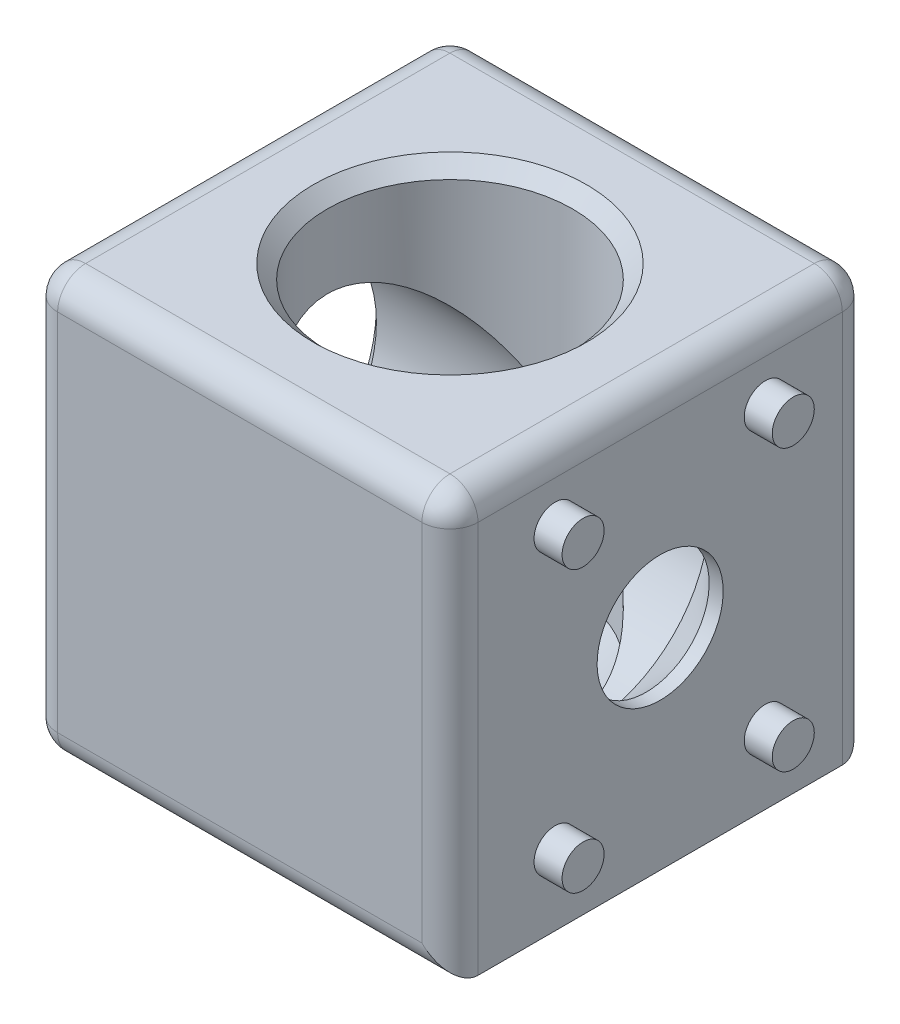
ISO-10303-21;
HEADER;
FILE_DESCRIPTION(('STEP AP214'),'2;1');
FILE_NAME('part.step','',(''),(''),'','','');
FILE_SCHEMA(('AUTOMOTIVE_DESIGN { 1 0 10303 214 1 1 1 1 }'));
ENDSEC;
DATA;
#1=APPLICATION_CONTEXT('core data for automotive mechanical design processes');
#2=APPLICATION_PROTOCOL_DEFINITION('international standard','automotive_design',2000,#1);
#3=PRODUCT_CONTEXT('',#1,'mechanical');
#4=PRODUCT('Part','Part','',(#3));
#5=PRODUCT_RELATED_PRODUCT_CATEGORY('part','',(#4));
#6=PRODUCT_DEFINITION_FORMATION('','',#4);
#7=PRODUCT_DEFINITION_CONTEXT('part definition',#1,'design');
#8=PRODUCT_DEFINITION('design','',#6,#7);
#9=PRODUCT_DEFINITION_SHAPE('','',#8);
#10=(LENGTH_UNIT() NAMED_UNIT(*) SI_UNIT(.MILLI.,.METRE.));
#11=(NAMED_UNIT(*) PLANE_ANGLE_UNIT() SI_UNIT($,.RADIAN.));
#12=(NAMED_UNIT(*) SI_UNIT($,.STERADIAN.) SOLID_ANGLE_UNIT());
#13=UNCERTAINTY_MEASURE_WITH_UNIT(LENGTH_MEASURE(1.E-05),#10,'distance_accuracy_value','');
#14=(GEOMETRIC_REPRESENTATION_CONTEXT(3) GLOBAL_UNCERTAINTY_ASSIGNED_CONTEXT((#13)) GLOBAL_UNIT_ASSIGNED_CONTEXT((#10,
#11,#12)) REPRESENTATION_CONTEXT('',''));
#15=CARTESIAN_POINT('',(0.,0.,0.));
#16=DIRECTION('',(0.,0.,1.));
#17=DIRECTION('',(1.,0.,0.));
#18=AXIS2_PLACEMENT_3D('',#15,#16,#17);
#19=CARTESIAN_POINT('',(0.,15.,0.));
#20=DIRECTION('',(0.,1.,0.));
#21=DIRECTION('',(-1.,0.,0.));
#22=AXIS2_PLACEMENT_3D('',#19,#20,#21);
#23=CYLINDRICAL_SURFACE('',#22,8.75);
#24=CARTESIAN_POINT('',(0.,14.,0.));
#25=DIRECTION('',(0.,1.,0.));
#26=DIRECTION('',(-1.,0.,0.));
#27=AXIS2_PLACEMENT_3D('',#24,#25,#26);
#28=CIRCLE('',#27,8.75);
#29=CARTESIAN_POINT('',(-8.75,14.,0.));
#30=VERTEX_POINT('',#29);
#31=EDGE_CURVE('E315',#30,#30,#28,.T.);
#32=ORIENTED_EDGE('',*,*,#31,.T.);
#33=EDGE_LOOP('',(#32));
#34=FACE_BOUND('',#33,.T.);
#35=CARTESIAN_POINT('',(0.,0.,0.));
#36=DIRECTION('',(0.707106781186547,0.707106781186548,0.));
#37=DIRECTION('',(-0.707106781186548,0.707106781186547,0.));
#38=AXIS2_PLACEMENT_3D('',#35,#36,#37);
#39=ELLIPSE('',#38,12.3743686707646,8.75);
#40=CARTESIAN_POINT('',(0.,0.,8.75));
#41=VERTEX_POINT('',#40);
#42=CARTESIAN_POINT('',(0.,0.,-8.75));
#43=VERTEX_POINT('',#42);
#44=EDGE_CURVE('E131',#41,#43,#39,.F.);
#45=ORIENTED_EDGE('',*,*,#44,.T.);
#46=CARTESIAN_POINT('',(0.,0.,0.));
#47=DIRECTION('',(-0.707106781186548,0.707106781186547,0.));
#48=DIRECTION('',(0.707106781186547,0.707106781186548,0.));
#49=AXIS2_PLACEMENT_3D('',#46,#47,#48);
#50=ELLIPSE('',#49,12.3743686707646,8.75);
#51=EDGE_CURVE('E127',#43,#41,#50,.F.);
#52=ORIENTED_EDGE('',*,*,#51,.T.);
#53=EDGE_LOOP('',(#45,#52));
#54=FACE_BOUND('',#53,.T.);
#55=ADVANCED_FACE('F35',(#34,#54),#23,.F.);
#56=CARTESIAN_POINT('',(15.,15.,15.));
#57=DIRECTION('',(-1.,0.,0.));
#58=DIRECTION('',(0.,0.,1.));
#59=AXIS2_PLACEMENT_3D('',#56,#57,#58);
#60=PLANE('',#59);
#61=DIRECTION('',(0.,0.,-1.));
#62=VECTOR('',#61,1.);
#63=CARTESIAN_POINT('',(15.,-15.,15.));
#64=LINE('',#63,#62);
#65=CARTESIAN_POINT('',(15.,-15.,13.));
#66=VERTEX_POINT('',#65);
#67=CARTESIAN_POINT('',(15.,-15.,-13.));
#68=VERTEX_POINT('',#67);
#69=EDGE_CURVE('E137',#66,#68,#64,.T.);
#70=ORIENTED_EDGE('',*,*,#69,.T.);
#71=DIRECTION('',(0.,-1.,0.));
#72=VECTOR('',#71,1.);
#73=CARTESIAN_POINT('',(15.,15.,-13.));
#74=LINE('',#73,#72);
#75=CARTESIAN_POINT('',(15.,13.,-13.));
#76=VERTEX_POINT('',#75);
#77=EDGE_CURVE('E164',#68,#76,#74,.F.);
#78=ORIENTED_EDGE('',*,*,#77,.T.);
#79=DIRECTION('',(0.,0.,-1.));
#80=VECTOR('',#79,1.);
#81=CARTESIAN_POINT('',(15.,13.,15.));
#82=LINE('',#81,#80);
#83=CARTESIAN_POINT('',(15.,13.,13.));
#84=VERTEX_POINT('',#83);
#85=EDGE_CURVE('E160',#76,#84,#82,.F.);
#86=ORIENTED_EDGE('',*,*,#85,.T.);
#87=DIRECTION('',(0.,-1.,0.));
#88=VECTOR('',#87,1.);
#89=CARTESIAN_POINT('',(15.,15.,13.));
#90=LINE('',#89,#88);
#91=EDGE_CURVE('E162',#84,#66,#90,.T.);
#92=ORIENTED_EDGE('',*,*,#91,.T.);
#93=EDGE_LOOP('',(#70,#78,#86,#92));
#94=FACE_BOUND('',#93,.T.);
#95=CARTESIAN_POINT('',(15.,-9.99999999999999,7.5));
#96=DIRECTION('',(-1.,0.,0.));
#97=DIRECTION('',(0.,0.,-1.));
#98=AXIS2_PLACEMENT_3D('',#95,#96,#97);
#99=CIRCLE('',#98,1.5);
#100=CARTESIAN_POINT('',(15.,-9.99999999999999,6.));
#101=VERTEX_POINT('',#100);
#102=EDGE_CURVE('E242',#101,#101,#99,.T.);
#103=ORIENTED_EDGE('',*,*,#102,.T.);
#104=EDGE_LOOP('',(#103));
#105=FACE_BOUND('',#104,.T.);
#106=CARTESIAN_POINT('',(15.,-9.99999999999999,-7.5));
#107=DIRECTION('',(-1.,0.,0.));
#108=DIRECTION('',(0.,0.,-1.));
#109=AXIS2_PLACEMENT_3D('',#106,#107,#108);
#110=CIRCLE('',#109,1.5);
#111=CARTESIAN_POINT('',(15.,-9.99999999999999,-9.));
#112=VERTEX_POINT('',#111);
#113=EDGE_CURVE('E253',#112,#112,#110,.T.);
#114=ORIENTED_EDGE('',*,*,#113,.T.);
#115=EDGE_LOOP('',(#114));
#116=FACE_BOUND('',#115,.T.);
#117=CARTESIAN_POINT('',(15.,10.,7.5));
#118=DIRECTION('',(-1.,0.,0.));
#119=DIRECTION('',(0.,0.,-1.));
#120=AXIS2_PLACEMENT_3D('',#117,#118,#119);
#121=CIRCLE('',#120,1.5);
#122=CARTESIAN_POINT('',(15.,10.,6.));
#123=VERTEX_POINT('',#122);
#124=EDGE_CURVE('E259',#123,#123,#121,.T.);
#125=ORIENTED_EDGE('',*,*,#124,.T.);
#126=EDGE_LOOP('',(#125));
#127=FACE_BOUND('',#126,.T.);
#128=CARTESIAN_POINT('',(15.,10.,-7.5));
#129=DIRECTION('',(-1.,0.,0.));
#130=DIRECTION('',(0.,0.,-1.));
#131=AXIS2_PLACEMENT_3D('',#128,#129,#130);
#132=CIRCLE('',#131,1.5);
#133=CARTESIAN_POINT('',(15.,10.,-9.));
#134=VERTEX_POINT('',#133);
#135=EDGE_CURVE('E265',#134,#134,#132,.T.);
#136=ORIENTED_EDGE('',*,*,#135,.T.);
#137=EDGE_LOOP('',(#136));
#138=FACE_BOUND('',#137,.T.);
#139=CARTESIAN_POINT('',(15.,0.,0.));
#140=DIRECTION('',(1.,0.,0.));
#141=DIRECTION('',(0.,1.,0.));
#142=AXIS2_PLACEMENT_3D('',#139,#140,#141);
#143=CIRCLE('',#142,4.5);
#144=CARTESIAN_POINT('',(15.,4.5,0.));
#145=VERTEX_POINT('',#144);
#146=EDGE_CURVE('E285',#145,#145,#143,.T.);
#147=ORIENTED_EDGE('',*,*,#146,.F.);
#148=EDGE_LOOP('',(#147));
#149=FACE_BOUND('',#148,.T.);
#150=ADVANCED_FACE('F330',(#94,#105,#116,#127,#138,#149),#60,.F.);
#151=CARTESIAN_POINT('',(-15.,15.,-15.));
#152=DIRECTION('',(0.,0.,1.));
#153=DIRECTION('',(1.,0.,0.));
#154=AXIS2_PLACEMENT_3D('',#151,#152,#153);
#155=PLANE('',#154);
#156=DIRECTION('',(0.,-1.,0.));
#157=VECTOR('',#156,1.);
#158=CARTESIAN_POINT('',(13.,15.,-15.));
#159=LINE('',#158,#157);
#160=CARTESIAN_POINT('',(13.,13.,-15.));
#161=VERTEX_POINT('',#160);
#162=CARTESIAN_POINT('',(13.,-13.,-15.));
#163=VERTEX_POINT('',#162);
#164=EDGE_CURVE('E148',#161,#163,#159,.T.);
#165=ORIENTED_EDGE('',*,*,#164,.T.);
#166=DIRECTION('',(-1.,0.,0.));
#167=VECTOR('',#166,1.);
#168=CARTESIAN_POINT('',(-15.,-13.,-15.));
#169=LINE('',#168,#167);
#170=CARTESIAN_POINT('',(-13.,-13.,-15.));
#171=VERTEX_POINT('',#170);
#172=EDGE_CURVE('E150',#163,#171,#169,.T.);
#173=ORIENTED_EDGE('',*,*,#172,.T.);
#174=DIRECTION('',(0.,-1.,0.));
#175=VECTOR('',#174,1.);
#176=CARTESIAN_POINT('',(-13.,15.,-15.));
#177=LINE('',#176,#175);
#178=CARTESIAN_POINT('',(-13.,13.,-15.));
#179=VERTEX_POINT('',#178);
#180=EDGE_CURVE('E146',#171,#179,#177,.F.);
#181=ORIENTED_EDGE('',*,*,#180,.T.);
#182=DIRECTION('',(-1.,0.,0.));
#183=VECTOR('',#182,1.);
#184=CARTESIAN_POINT('',(-15.,13.,-15.));
#185=LINE('',#184,#183);
#186=EDGE_CURVE('E139',#179,#161,#185,.F.);
#187=ORIENTED_EDGE('',*,*,#186,.T.);
#188=EDGE_LOOP('',(#165,#173,#181,#187));
#189=FACE_BOUND('',#188,.T.);
#190=ADVANCED_FACE('F371',(#189),#155,.F.);
#191=CARTESIAN_POINT('',(-15.,15.,15.));
#192=DIRECTION('',(1.,0.,0.));
#193=DIRECTION('',(0.,0.,-1.));
#194=AXIS2_PLACEMENT_3D('',#191,#192,#193);
#195=PLANE('',#194);
#196=DIRECTION('',(0.,-1.,0.));
#197=VECTOR('',#196,1.);
#198=CARTESIAN_POINT('',(-15.,15.,-13.));
#199=LINE('',#198,#197);
#200=CARTESIAN_POINT('',(-15.,13.,-13.));
#201=VERTEX_POINT('',#200);
#202=CARTESIAN_POINT('',(-15.,-13.,-13.));
#203=VERTEX_POINT('',#202);
#204=EDGE_CURVE('E175',#201,#203,#199,.T.);
#205=ORIENTED_EDGE('',*,*,#204,.T.);
#206=DIRECTION('',(0.,0.,1.));
#207=VECTOR('',#206,1.);
#208=CARTESIAN_POINT('',(-15.,-13.,15.));
#209=LINE('',#208,#207);
#210=CARTESIAN_POINT('',(-15.,-13.,13.));
#211=VERTEX_POINT('',#210);
#212=EDGE_CURVE('E181',#203,#211,#209,.T.);
#213=ORIENTED_EDGE('',*,*,#212,.T.);
#214=DIRECTION('',(0.,-1.,0.));
#215=VECTOR('',#214,1.);
#216=CARTESIAN_POINT('',(-15.,15.,13.));
#217=LINE('',#216,#215);
#218=CARTESIAN_POINT('',(-15.,13.,13.));
#219=VERTEX_POINT('',#218);
#220=EDGE_CURVE('E179',#211,#219,#217,.F.);
#221=ORIENTED_EDGE('',*,*,#220,.T.);
#222=DIRECTION('',(0.,0.,1.));
#223=VECTOR('',#222,1.);
#224=CARTESIAN_POINT('',(-15.,13.,15.));
#225=LINE('',#224,#223);
#226=EDGE_CURVE('E177',#219,#201,#225,.F.);
#227=ORIENTED_EDGE('',*,*,#226,.T.);
#228=EDGE_LOOP('',(#205,#213,#221,#227));
#229=FACE_BOUND('',#228,.T.);
#230=CARTESIAN_POINT('',(-15.,0.,0.));
#231=DIRECTION('',(1.,0.,0.));
#232=DIRECTION('',(0.,1.,0.));
#233=AXIS2_PLACEMENT_3D('',#230,#231,#232);
#234=CIRCLE('',#233,9.75);
#235=CARTESIAN_POINT('',(-15.,9.74999999999999,0.));
#236=VERTEX_POINT('',#235);
#237=EDGE_CURVE('E271',#236,#236,#234,.T.);
#238=ORIENTED_EDGE('',*,*,#237,.T.);
#239=EDGE_LOOP('',(#238));
#240=FACE_BOUND('',#239,.T.);
#241=ADVANCED_FACE('F428',(#229,#240),#195,.F.);
#242=CARTESIAN_POINT('',(-15.,15.,15.));
#243=DIRECTION('',(0.,0.,-1.));
#244=DIRECTION('',(-1.,0.,0.));
#245=AXIS2_PLACEMENT_3D('',#242,#243,#244);
#246=PLANE('',#245);
#247=DIRECTION('',(0.,-1.,0.));
#248=VECTOR('',#247,1.);
#249=CARTESIAN_POINT('',(-13.,15.,15.));
#250=LINE('',#249,#248);
#251=CARTESIAN_POINT('',(-13.,13.,15.));
#252=VERTEX_POINT('',#251);
#253=CARTESIAN_POINT('',(-13.,-13.,15.));
#254=VERTEX_POINT('',#253);
#255=EDGE_CURVE('E168',#252,#254,#250,.T.);
#256=ORIENTED_EDGE('',*,*,#255,.T.);
#257=DIRECTION('',(1.,0.,0.));
#258=VECTOR('',#257,1.);
#259=CARTESIAN_POINT('',(15.,-13.,15.));
#260=LINE('',#259,#258);
#261=CARTESIAN_POINT('',(13.,-13.,15.));
#262=VERTEX_POINT('',#261);
#263=EDGE_CURVE('E172',#254,#262,#260,.T.);
#264=ORIENTED_EDGE('',*,*,#263,.T.);
#265=DIRECTION('',(0.,-1.,0.));
#266=VECTOR('',#265,1.);
#267=CARTESIAN_POINT('',(13.,15.,15.));
#268=LINE('',#267,#266);
#269=CARTESIAN_POINT('',(13.,13.,15.));
#270=VERTEX_POINT('',#269);
#271=EDGE_CURVE('E170',#262,#270,#268,.F.);
#272=ORIENTED_EDGE('',*,*,#271,.T.);
#273=DIRECTION('',(1.,0.,0.));
#274=VECTOR('',#273,1.);
#275=CARTESIAN_POINT('',(-15.,13.,15.));
#276=LINE('',#275,#274);
#277=EDGE_CURVE('E166',#270,#252,#276,.F.);
#278=ORIENTED_EDGE('',*,*,#277,.T.);
#279=EDGE_LOOP('',(#256,#264,#272,#278));
#280=FACE_BOUND('',#279,.T.);
#281=ADVANCED_FACE('F390',(#280),#246,.F.);
#282=CARTESIAN_POINT('',(0.,15.,0.));
#283=DIRECTION('',(0.,-1.,0.));
#284=DIRECTION('',(0.,0.,-1.));
#285=AXIS2_PLACEMENT_3D('',#282,#283,#284);
#286=PLANE('',#285);
#287=DIRECTION('',(1.,0.,0.));
#288=VECTOR('',#287,1.);
#289=CARTESIAN_POINT('',(0.,15.,13.));
#290=LINE('',#289,#288);
#291=CARTESIAN_POINT('',(-13.,15.,13.));
#292=VERTEX_POINT('',#291);
#293=CARTESIAN_POINT('',(13.,15.,13.));
#294=VERTEX_POINT('',#293);
#295=EDGE_CURVE('E44',#292,#294,#290,.T.);
#296=ORIENTED_EDGE('',*,*,#295,.T.);
#297=DIRECTION('',(0.,0.,-1.));
#298=VECTOR('',#297,1.);
#299=CARTESIAN_POINT('',(13.,15.,0.));
#300=LINE('',#299,#298);
#301=CARTESIAN_POINT('',(13.,15.,-13.));
#302=VERTEX_POINT('',#301);
#303=EDGE_CURVE('E11',#294,#302,#300,.T.);
#304=ORIENTED_EDGE('',*,*,#303,.T.);
#305=DIRECTION('',(-1.,0.,0.));
#306=VECTOR('',#305,1.);
#307=CARTESIAN_POINT('',(0.,15.,-13.));
#308=LINE('',#307,#306);
#309=CARTESIAN_POINT('',(-13.,15.,-13.));
#310=VERTEX_POINT('',#309);
#311=EDGE_CURVE('E184',#302,#310,#308,.T.);
#312=ORIENTED_EDGE('',*,*,#311,.T.);
#313=DIRECTION('',(0.,0.,1.));
#314=VECTOR('',#313,1.);
#315=CARTESIAN_POINT('',(-13.,15.,0.));
#316=LINE('',#315,#314);
#317=EDGE_CURVE('E55',#310,#292,#316,.T.);
#318=ORIENTED_EDGE('',*,*,#317,.T.);
#319=EDGE_LOOP('',(#296,#304,#312,#318));
#320=FACE_BOUND('',#319,.T.);
#321=CARTESIAN_POINT('',(0.,15.,0.));
#322=DIRECTION('',(0.,1.,0.));
#323=DIRECTION('',(-1.,0.,0.));
#324=AXIS2_PLACEMENT_3D('',#321,#322,#323);
#325=CIRCLE('',#324,9.75);
#326=CARTESIAN_POINT('',(-9.75,15.,0.));
#327=VERTEX_POINT('',#326);
#328=EDGE_CURVE('E310',#327,#327,#325,.T.);
#329=ORIENTED_EDGE('',*,*,#328,.F.);
#330=EDGE_LOOP('',(#329));
#331=FACE_BOUND('',#330,.T.);
#332=ADVANCED_FACE('F387',(#320,#331),#286,.F.);
#333=CARTESIAN_POINT('',(0.,-15.,0.));
#334=DIRECTION('',(0.,-1.,0.));
#335=DIRECTION('',(0.,0.,-1.));
#336=AXIS2_PLACEMENT_3D('',#333,#334,#335);
#337=PLANE('',#336);
#338=CARTESIAN_POINT('',(10.,-15.,7.5));
#339=DIRECTION('',(0.,-1.,0.));
#340=DIRECTION('',(0.,0.,-1.));
#341=AXIS2_PLACEMENT_3D('',#338,#339,#340);
#342=CIRCLE('',#341,1.5);
#343=CARTESIAN_POINT('',(10.,-15.,6.));
#344=VERTEX_POINT('',#343);
#345=EDGE_CURVE('E288',#344,#344,#342,.T.);
#346=ORIENTED_EDGE('',*,*,#345,.F.);
#347=EDGE_LOOP('',(#346));
#348=FACE_BOUND('',#347,.T.);
#349=CARTESIAN_POINT('',(10.,-15.,-7.5));
#350=DIRECTION('',(0.,-1.,0.));
#351=DIRECTION('',(0.,0.,-1.));
#352=AXIS2_PLACEMENT_3D('',#349,#350,#351);
#353=CIRCLE('',#352,1.5);
#354=CARTESIAN_POINT('',(10.,-15.,-9.));
#355=VERTEX_POINT('',#354);
#356=EDGE_CURVE('E292',#355,#355,#353,.T.);
#357=ORIENTED_EDGE('',*,*,#356,.F.);
#358=EDGE_LOOP('',(#357));
#359=FACE_BOUND('',#358,.T.);
#360=CARTESIAN_POINT('',(-10.,-15.,7.5));
#361=DIRECTION('',(0.,-1.,0.));
#362=DIRECTION('',(0.,0.,-1.));
#363=AXIS2_PLACEMENT_3D('',#360,#361,#362);
#364=CIRCLE('',#363,1.5);
#365=CARTESIAN_POINT('',(-10.,-15.,6.));
#366=VERTEX_POINT('',#365);
#367=EDGE_CURVE('E298',#366,#366,#364,.T.);
#368=ORIENTED_EDGE('',*,*,#367,.F.);
#369=EDGE_LOOP('',(#368));
#370=FACE_BOUND('',#369,.T.);
#371=CARTESIAN_POINT('',(-10.,-15.,-7.5));
#372=DIRECTION('',(0.,-1.,0.));
#373=DIRECTION('',(0.,0.,-1.));
#374=AXIS2_PLACEMENT_3D('',#371,#372,#373);
#375=CIRCLE('',#374,1.5);
#376=CARTESIAN_POINT('',(-10.,-15.,-9.));
#377=VERTEX_POINT('',#376);
#378=EDGE_CURVE('E304',#377,#377,#375,.T.);
#379=ORIENTED_EDGE('',*,*,#378,.F.);
#380=EDGE_LOOP('',(#379));
#381=FACE_BOUND('',#380,.T.);
#382=CARTESIAN_POINT('',(0.,-15.,0.));
#383=DIRECTION('',(0.,1.,0.));
#384=DIRECTION('',(-1.,0.,0.));
#385=AXIS2_PLACEMENT_3D('',#382,#383,#384);
#386=CIRCLE('',#385,4.5);
#387=CARTESIAN_POINT('',(-4.5,-15.,0.));
#388=VERTEX_POINT('',#387);
#389=EDGE_CURVE('E324',#388,#388,#386,.T.);
#390=ORIENTED_EDGE('',*,*,#389,.T.);
#391=EDGE_LOOP('',(#390));
#392=FACE_BOUND('',#391,.T.);
#393=DIRECTION('',(0.,0.,1.));
#394=VECTOR('',#393,1.);
#395=CARTESIAN_POINT('',(-13.,-15.,-15.));
#396=LINE('',#395,#394);
#397=CARTESIAN_POINT('',(-13.,-15.,13.));
#398=VERTEX_POINT('',#397);
#399=CARTESIAN_POINT('',(-13.,-15.,-13.));
#400=VERTEX_POINT('',#399);
#401=EDGE_CURVE('E153',#398,#400,#396,.F.);
#402=ORIENTED_EDGE('',*,*,#401,.T.);
#403=DIRECTION('',(-1.,0.,0.));
#404=VECTOR('',#403,1.);
#405=CARTESIAN_POINT('',(15.,-15.,-13.));
#406=LINE('',#405,#404);
#407=EDGE_CURVE('E157',#400,#68,#406,.F.);
#408=ORIENTED_EDGE('',*,*,#407,.T.);
#409=ORIENTED_EDGE('',*,*,#69,.F.);
#410=DIRECTION('',(1.,0.,0.));
#411=VECTOR('',#410,1.);
#412=CARTESIAN_POINT('',(-15.,-15.,13.));
#413=LINE('',#412,#411);
#414=EDGE_CURVE('E155',#66,#398,#413,.F.);
#415=ORIENTED_EDGE('',*,*,#414,.T.);
#416=EDGE_LOOP('',(#402,#408,#409,#415));
#417=FACE_BOUND('',#416,.T.);
#418=ADVANCED_FACE('F336',(#348,#359,#370,#381,#392,#417),#337,.T.);
#419=CARTESIAN_POINT('',(0.,15.,0.));
#420=DIRECTION('',(0.,1.,0.));
#421=DIRECTION('',(-1.,0.,0.));
#422=AXIS2_PLACEMENT_3D('',#419,#420,#421);
#423=CYLINDRICAL_SURFACE('',#422,4.5);
#424=ORIENTED_EDGE('',*,*,#389,.F.);
#425=EDGE_LOOP('',(#424));
#426=FACE_BOUND('',#425,.T.);
#427=CARTESIAN_POINT('',(0.,-14.,0.));
#428=DIRECTION('',(0.,1.,0.));
#429=DIRECTION('',(-1.,0.,0.));
#430=AXIS2_PLACEMENT_3D('',#427,#428,#429);
#431=CIRCLE('',#430,4.5);
#432=CARTESIAN_POINT('',(-4.5,-14.,0.));
#433=VERTEX_POINT('',#432);
#434=EDGE_CURVE('E321',#433,#433,#431,.T.);
#435=ORIENTED_EDGE('',*,*,#434,.T.);
#436=EDGE_LOOP('',(#435));
#437=FACE_BOUND('',#436,.T.);
#438=ADVANCED_FACE('F418',(#426,#437),#423,.F.);
#439=CARTESIAN_POINT('',(0.,-9.75000000000001,0.));
#440=DIRECTION('',(0.,1.,0.));
#441=DIRECTION('',(-1.,0.,0.));
#442=AXIS2_PLACEMENT_3D('',#439,#440,#441);
#443=CONICAL_SURFACE('',#442,8.75,0.78539816339745);
#444=ORIENTED_EDGE('',*,*,#434,.F.);
#445=EDGE_LOOP('',(#444));
#446=FACE_BOUND('',#445,.T.);
#447=CARTESIAN_POINT('',(0.,-9.75000000000001,0.));
#448=DIRECTION('',(0.,1.,0.));
#449=DIRECTION('',(-1.,0.,0.));
#450=AXIS2_PLACEMENT_3D('',#447,#448,#449);
#451=CIRCLE('',#450,8.75);
#452=CARTESIAN_POINT('',(-8.75,-9.75000000000001,0.));
#453=VERTEX_POINT('',#452);
#454=EDGE_CURVE('E318',#453,#453,#451,.T.);
#455=ORIENTED_EDGE('',*,*,#454,.T.);
#456=EDGE_LOOP('',(#455));
#457=FACE_BOUND('',#456,.T.);
#458=ADVANCED_FACE('F406',(#446,#457),#443,.F.);
#459=CARTESIAN_POINT('',(0.,0.,0.));
#460=DIRECTION('',(0.707106781186547,0.707106781186548,0.));
#461=DIRECTION('',(-0.707106781186548,0.707106781186547,0.));
#462=AXIS2_PLACEMENT_3D('',#459,#460,#461);
#463=ELLIPSE('',#462,12.3743686707646,8.75);
#464=EDGE_CURVE('E123',#41,#43,#463,.T.);
#465=ORIENTED_EDGE('',*,*,#464,.T.);
#466=CARTESIAN_POINT('',(0.,0.,0.));
#467=DIRECTION('',(-0.707106781186548,0.707106781186547,0.));
#468=DIRECTION('',(0.707106781186547,0.707106781186548,0.));
#469=AXIS2_PLACEMENT_3D('',#466,#467,#468);
#470=ELLIPSE('',#469,12.3743686707646,8.75);
#471=EDGE_CURVE('E130',#43,#41,#470,.T.);
#472=ORIENTED_EDGE('',*,*,#471,.T.);
#473=EDGE_LOOP('',(#465,#472));
#474=FACE_BOUND('',#473,.T.);
#475=ORIENTED_EDGE('',*,*,#454,.F.);
#476=EDGE_LOOP('',(#475));
#477=FACE_BOUND('',#476,.T.);
#478=ADVANCED_FACE('F141',(#474,#477),#23,.F.);
#479=CARTESIAN_POINT('',(0.,15.,0.));
#480=DIRECTION('',(0.,1.,0.));
#481=DIRECTION('',(-1.,0.,0.));
#482=AXIS2_PLACEMENT_3D('',#479,#480,#481);
#483=CONICAL_SURFACE('',#482,9.75,0.78539816339745);
#484=ORIENTED_EDGE('',*,*,#31,.F.);
#485=EDGE_LOOP('',(#484));
#486=FACE_BOUND('',#485,.T.);
#487=ORIENTED_EDGE('',*,*,#328,.T.);
#488=EDGE_LOOP('',(#487));
#489=FACE_BOUND('',#488,.T.);
#490=ADVANCED_FACE('F394',(#486,#489),#483,.F.);
#491=CARTESIAN_POINT('',(-10.,-17.,-7.5));
#492=DIRECTION('',(0.,1.,0.));
#493=DIRECTION('',(0.,0.,1.));
#494=AXIS2_PLACEMENT_3D('',#491,#492,#493);
#495=CYLINDRICAL_SURFACE('',#494,1.5);
#496=CARTESIAN_POINT('',(-10.,-17.,-7.5));
#497=DIRECTION('',(0.,-1.,0.));
#498=DIRECTION('',(0.,0.,-1.));
#499=AXIS2_PLACEMENT_3D('',#496,#497,#498);
#500=CIRCLE('',#499,1.5);
#501=CARTESIAN_POINT('',(-10.,-17.,-9.));
#502=VERTEX_POINT('',#501);
#503=EDGE_CURVE('E307',#502,#502,#500,.T.);
#504=ORIENTED_EDGE('',*,*,#503,.F.);
#505=EDGE_LOOP('',(#504));
#506=FACE_BOUND('',#505,.T.);
#507=ORIENTED_EDGE('',*,*,#378,.T.);
#508=EDGE_LOOP('',(#507));
#509=FACE_BOUND('',#508,.T.);
#510=ADVANCED_FACE('F396',(#506,#509),#495,.T.);
#511=CARTESIAN_POINT('',(-10.,-17.,-7.5));
#512=DIRECTION('',(0.,-1.,0.));
#513=DIRECTION('',(0.,0.,-1.));
#514=AXIS2_PLACEMENT_3D('',#511,#512,#513);
#515=PLANE('',#514);
#516=ORIENTED_EDGE('',*,*,#503,.T.);
#517=EDGE_LOOP('',(#516));
#518=FACE_BOUND('',#517,.T.);
#519=ADVANCED_FACE('F403',(#518),#515,.T.);
#520=CARTESIAN_POINT('',(-10.,-17.,7.5));
#521=DIRECTION('',(0.,1.,0.));
#522=DIRECTION('',(0.,0.,1.));
#523=AXIS2_PLACEMENT_3D('',#520,#521,#522);
#524=CYLINDRICAL_SURFACE('',#523,1.5);
#525=CARTESIAN_POINT('',(-10.,-17.,7.5));
#526=DIRECTION('',(0.,-1.,0.));
#527=DIRECTION('',(0.,0.,-1.));
#528=AXIS2_PLACEMENT_3D('',#525,#526,#527);
#529=CIRCLE('',#528,1.5);
#530=CARTESIAN_POINT('',(-10.,-17.,6.));
#531=VERTEX_POINT('',#530);
#532=EDGE_CURVE('E301',#531,#531,#529,.T.);
#533=ORIENTED_EDGE('',*,*,#532,.F.);
#534=EDGE_LOOP('',(#533));
#535=FACE_BOUND('',#534,.T.);
#536=ORIENTED_EDGE('',*,*,#367,.T.);
#537=EDGE_LOOP('',(#536));
#538=FACE_BOUND('',#537,.T.);
#539=ADVANCED_FACE('F527',(#535,#538),#524,.T.);
#540=CARTESIAN_POINT('',(-10.,-17.,7.5));
#541=DIRECTION('',(0.,-1.,0.));
#542=DIRECTION('',(0.,0.,-1.));
#543=AXIS2_PLACEMENT_3D('',#540,#541,#542);
#544=PLANE('',#543);
#545=ORIENTED_EDGE('',*,*,#532,.T.);
#546=EDGE_LOOP('',(#545));
#547=FACE_BOUND('',#546,.T.);
#548=ADVANCED_FACE('F523',(#547),#544,.T.);
#549=CARTESIAN_POINT('',(10.,-17.,-7.5));
#550=DIRECTION('',(0.,1.,0.));
#551=DIRECTION('',(0.,0.,1.));
#552=AXIS2_PLACEMENT_3D('',#549,#550,#551);
#553=CYLINDRICAL_SURFACE('',#552,1.5);
#554=CARTESIAN_POINT('',(10.,-17.,-7.5));
#555=DIRECTION('',(0.,-1.,0.));
#556=DIRECTION('',(0.,0.,-1.));
#557=AXIS2_PLACEMENT_3D('',#554,#555,#556);
#558=CIRCLE('',#557,1.5);
#559=CARTESIAN_POINT('',(10.,-17.,-9.));
#560=VERTEX_POINT('',#559);
#561=EDGE_CURVE('E295',#560,#560,#558,.T.);
#562=ORIENTED_EDGE('',*,*,#561,.F.);
#563=EDGE_LOOP('',(#562));
#564=FACE_BOUND('',#563,.T.);
#565=ORIENTED_EDGE('',*,*,#356,.T.);
#566=EDGE_LOOP('',(#565));
#567=FACE_BOUND('',#566,.T.);
#568=ADVANCED_FACE('F519',(#564,#567),#553,.T.);
#569=CARTESIAN_POINT('',(10.,-17.,-7.5));
#570=DIRECTION('',(0.,-1.,0.));
#571=DIRECTION('',(0.,0.,-1.));
#572=AXIS2_PLACEMENT_3D('',#569,#570,#571);
#573=PLANE('',#572);
#574=ORIENTED_EDGE('',*,*,#561,.T.);
#575=EDGE_LOOP('',(#574));
#576=FACE_BOUND('',#575,.T.);
#577=ADVANCED_FACE('F515',(#576),#573,.T.);
#578=CARTESIAN_POINT('',(10.,-17.,7.5));
#579=DIRECTION('',(0.,1.,0.));
#580=DIRECTION('',(0.,0.,1.));
#581=AXIS2_PLACEMENT_3D('',#578,#579,#580);
#582=CYLINDRICAL_SURFACE('',#581,1.5);
#583=CARTESIAN_POINT('',(10.,-17.,7.5));
#584=DIRECTION('',(0.,-1.,0.));
#585=DIRECTION('',(0.,0.,-1.));
#586=AXIS2_PLACEMENT_3D('',#583,#584,#585);
#587=CIRCLE('',#586,1.5);
#588=CARTESIAN_POINT('',(10.,-17.,6.));
#589=VERTEX_POINT('',#588);
#590=EDGE_CURVE('E289',#589,#589,#587,.T.);
#591=ORIENTED_EDGE('',*,*,#590,.F.);
#592=EDGE_LOOP('',(#591));
#593=FACE_BOUND('',#592,.T.);
#594=ORIENTED_EDGE('',*,*,#345,.T.);
#595=EDGE_LOOP('',(#594));
#596=FACE_BOUND('',#595,.T.);
#597=ADVANCED_FACE('F511',(#593,#596),#582,.T.);
#598=CARTESIAN_POINT('',(10.,-17.,7.5));
#599=DIRECTION('',(0.,-1.,0.));
#600=DIRECTION('',(0.,0.,-1.));
#601=AXIS2_PLACEMENT_3D('',#598,#599,#600);
#602=PLANE('',#601);
#603=ORIENTED_EDGE('',*,*,#590,.T.);
#604=EDGE_LOOP('',(#603));
#605=FACE_BOUND('',#604,.T.);
#606=ADVANCED_FACE('F496',(#605),#602,.T.);
#607=CARTESIAN_POINT('',(-15.,0.,0.));
#608=DIRECTION('',(-1.,0.,0.));
#609=DIRECTION('',(0.,1.,0.));
#610=AXIS2_PLACEMENT_3D('',#607,#608,#609);
#611=CYLINDRICAL_SURFACE('',#610,8.75);
#612=CARTESIAN_POINT('',(-14.,0.,0.));
#613=DIRECTION('',(1.,0.,0.));
#614=DIRECTION('',(0.,1.,0.));
#615=AXIS2_PLACEMENT_3D('',#612,#613,#614);
#616=CIRCLE('',#615,8.75);
#617=CARTESIAN_POINT('',(-14.,8.74999999999999,0.));
#618=VERTEX_POINT('',#617);
#619=EDGE_CURVE('E276',#618,#618,#616,.T.);
#620=ORIENTED_EDGE('',*,*,#619,.F.);
#621=EDGE_LOOP('',(#620));
#622=FACE_BOUND('',#621,.T.);
#623=ORIENTED_EDGE('',*,*,#44,.F.);
#624=ORIENTED_EDGE('',*,*,#471,.F.);
#625=EDGE_LOOP('',(#623,#624));
#626=FACE_BOUND('',#625,.T.);
#627=ADVANCED_FACE('F135',(#622,#626),#611,.F.);
#628=CARTESIAN_POINT('',(-15.,0.,0.));
#629=DIRECTION('',(-1.,0.,0.));
#630=DIRECTION('',(0.,1.,0.));
#631=AXIS2_PLACEMENT_3D('',#628,#629,#630);
#632=CONICAL_SURFACE('',#631,9.75,0.78539816339745);
#633=ORIENTED_EDGE('',*,*,#619,.T.);
#634=EDGE_LOOP('',(#633));
#635=FACE_BOUND('',#634,.T.);
#636=ORIENTED_EDGE('',*,*,#237,.F.);
#637=EDGE_LOOP('',(#636));
#638=FACE_BOUND('',#637,.T.);
#639=ADVANCED_FACE('F485',(#635,#638),#632,.F.);
#640=CARTESIAN_POINT('',(9.75000000000001,0.,0.));
#641=DIRECTION('',(1.,0.,0.));
#642=DIRECTION('',(0.,1.,0.));
#643=AXIS2_PLACEMENT_3D('',#640,#641,#642);
#644=CIRCLE('',#643,8.75);
#645=CARTESIAN_POINT('',(9.75000000000001,8.75,0.));
#646=VERTEX_POINT('',#645);
#647=EDGE_CURVE('E279',#646,#646,#644,.T.);
#648=ORIENTED_EDGE('',*,*,#647,.T.);
#649=EDGE_LOOP('',(#648));
#650=FACE_BOUND('',#649,.T.);
#651=ORIENTED_EDGE('',*,*,#464,.F.);
#652=ORIENTED_EDGE('',*,*,#51,.F.);
#653=EDGE_LOOP('',(#651,#652));
#654=FACE_BOUND('',#653,.T.);
#655=ADVANCED_FACE('F125',(#650,#654),#611,.F.);
#656=CARTESIAN_POINT('',(-15.,0.,0.));
#657=DIRECTION('',(-1.,0.,0.));
#658=DIRECTION('',(0.,1.,0.));
#659=AXIS2_PLACEMENT_3D('',#656,#657,#658);
#660=CYLINDRICAL_SURFACE('',#659,4.5);
#661=ORIENTED_EDGE('',*,*,#146,.T.);
#662=EDGE_LOOP('',(#661));
#663=FACE_BOUND('',#662,.T.);
#664=CARTESIAN_POINT('',(14.,0.,0.));
#665=DIRECTION('',(1.,0.,0.));
#666=DIRECTION('',(0.,1.,0.));
#667=AXIS2_PLACEMENT_3D('',#664,#665,#666);
#668=CIRCLE('',#667,4.5);
#669=CARTESIAN_POINT('',(14.,4.5,0.));
#670=VERTEX_POINT('',#669);
#671=EDGE_CURVE('E282',#670,#670,#668,.T.);
#672=ORIENTED_EDGE('',*,*,#671,.F.);
#673=EDGE_LOOP('',(#672));
#674=FACE_BOUND('',#673,.T.);
#675=ADVANCED_FACE('F493',(#663,#674),#660,.F.);
#676=CARTESIAN_POINT('',(9.75000000000001,0.,0.));
#677=DIRECTION('',(-1.,0.,0.));
#678=DIRECTION('',(0.,1.,0.));
#679=AXIS2_PLACEMENT_3D('',#676,#677,#678);
#680=CONICAL_SURFACE('',#679,8.75,0.78539816339745);
#681=ORIENTED_EDGE('',*,*,#671,.T.);
#682=EDGE_LOOP('',(#681));
#683=FACE_BOUND('',#682,.T.);
#684=ORIENTED_EDGE('',*,*,#647,.F.);
#685=EDGE_LOOP('',(#684));
#686=FACE_BOUND('',#685,.T.);
#687=ADVANCED_FACE('F502',(#683,#686),#680,.F.);
#688=CARTESIAN_POINT('',(17.,10.,-7.5));
#689=DIRECTION('',(-1.,0.,0.));
#690=DIRECTION('',(0.,-1.,0.));
#691=AXIS2_PLACEMENT_3D('',#688,#689,#690);
#692=CYLINDRICAL_SURFACE('',#691,1.5);
#693=CARTESIAN_POINT('',(17.,10.,-7.5));
#694=DIRECTION('',(-1.,0.,0.));
#695=DIRECTION('',(0.,0.,-1.));
#696=AXIS2_PLACEMENT_3D('',#693,#694,#695);
#697=CIRCLE('',#696,1.5);
#698=CARTESIAN_POINT('',(17.,10.,-9.));
#699=VERTEX_POINT('',#698);
#700=EDGE_CURVE('E268',#699,#699,#697,.T.);
#701=ORIENTED_EDGE('',*,*,#700,.T.);
#702=EDGE_LOOP('',(#701));
#703=FACE_BOUND('',#702,.T.);
#704=ORIENTED_EDGE('',*,*,#135,.F.);
#705=EDGE_LOOP('',(#704));
#706=FACE_BOUND('',#705,.T.);
#707=ADVANCED_FACE('F499',(#703,#706),#692,.T.);
#708=CARTESIAN_POINT('',(17.,10.,-7.5));
#709=DIRECTION('',(1.,0.,0.));
#710=DIRECTION('',(0.,0.,-1.));
#711=AXIS2_PLACEMENT_3D('',#708,#709,#710);
#712=PLANE('',#711);
#713=ORIENTED_EDGE('',*,*,#700,.F.);
#714=EDGE_LOOP('',(#713));
#715=FACE_BOUND('',#714,.T.);
#716=ADVANCED_FACE('F611',(#715),#712,.T.);
#717=CARTESIAN_POINT('',(17.,10.,7.5));
#718=DIRECTION('',(-1.,0.,0.));
#719=DIRECTION('',(0.,-1.,0.));
#720=AXIS2_PLACEMENT_3D('',#717,#718,#719);
#721=CYLINDRICAL_SURFACE('',#720,1.5);
#722=CARTESIAN_POINT('',(17.,10.,7.5));
#723=DIRECTION('',(-1.,0.,0.));
#724=DIRECTION('',(0.,0.,-1.));
#725=AXIS2_PLACEMENT_3D('',#722,#723,#724);
#726=CIRCLE('',#725,1.5);
#727=CARTESIAN_POINT('',(17.,10.,6.));
#728=VERTEX_POINT('',#727);
#729=EDGE_CURVE('E262',#728,#728,#726,.T.);
#730=ORIENTED_EDGE('',*,*,#729,.T.);
#731=EDGE_LOOP('',(#730));
#732=FACE_BOUND('',#731,.T.);
#733=ORIENTED_EDGE('',*,*,#124,.F.);
#734=EDGE_LOOP('',(#733));
#735=FACE_BOUND('',#734,.T.);
#736=ADVANCED_FACE('F620',(#732,#735),#721,.T.);
#737=CARTESIAN_POINT('',(17.,10.,7.5));
#738=DIRECTION('',(1.,0.,0.));
#739=DIRECTION('',(0.,0.,-1.));
#740=AXIS2_PLACEMENT_3D('',#737,#738,#739);
#741=PLANE('',#740);
#742=ORIENTED_EDGE('',*,*,#729,.F.);
#743=EDGE_LOOP('',(#742));
#744=FACE_BOUND('',#743,.T.);
#745=ADVANCED_FACE('F629',(#744),#741,.T.);
#746=CARTESIAN_POINT('',(17.,-9.99999999999999,-7.5));
#747=DIRECTION('',(-1.,0.,0.));
#748=DIRECTION('',(0.,-1.,0.));
#749=AXIS2_PLACEMENT_3D('',#746,#747,#748);
#750=CYLINDRICAL_SURFACE('',#749,1.5);
#751=CARTESIAN_POINT('',(17.,-9.99999999999999,-7.5));
#752=DIRECTION('',(-1.,0.,0.));
#753=DIRECTION('',(0.,0.,-1.));
#754=AXIS2_PLACEMENT_3D('',#751,#752,#753);
#755=CIRCLE('',#754,1.5);
#756=CARTESIAN_POINT('',(17.,-9.99999999999999,-9.));
#757=VERTEX_POINT('',#756);
#758=EDGE_CURVE('E256',#757,#757,#755,.T.);
#759=ORIENTED_EDGE('',*,*,#758,.T.);
#760=EDGE_LOOP('',(#759));
#761=FACE_BOUND('',#760,.T.);
#762=ORIENTED_EDGE('',*,*,#113,.F.);
#763=EDGE_LOOP('',(#762));
#764=FACE_BOUND('',#763,.T.);
#765=ADVANCED_FACE('F639',(#761,#764),#750,.T.);
#766=CARTESIAN_POINT('',(17.,-9.99999999999999,-7.5));
#767=DIRECTION('',(1.,0.,0.));
#768=DIRECTION('',(0.,0.,-1.));
#769=AXIS2_PLACEMENT_3D('',#766,#767,#768);
#770=PLANE('',#769);
#771=ORIENTED_EDGE('',*,*,#758,.F.);
#772=EDGE_LOOP('',(#771));
#773=FACE_BOUND('',#772,.T.);
#774=ADVANCED_FACE('F649',(#773),#770,.T.);
#775=CARTESIAN_POINT('',(17.,-9.99999999999999,7.5));
#776=DIRECTION('',(-1.,0.,0.));
#777=DIRECTION('',(0.,-1.,0.));
#778=AXIS2_PLACEMENT_3D('',#775,#776,#777);
#779=CYLINDRICAL_SURFACE('',#778,1.5);
#780=CARTESIAN_POINT('',(17.,-9.99999999999999,7.5));
#781=DIRECTION('',(-1.,0.,0.));
#782=DIRECTION('',(0.,0.,-1.));
#783=AXIS2_PLACEMENT_3D('',#780,#781,#782);
#784=CIRCLE('',#783,1.5);
#785=CARTESIAN_POINT('',(17.,-9.99999999999999,6.));
#786=VERTEX_POINT('',#785);
#787=EDGE_CURVE('E248',#786,#786,#784,.T.);
#788=ORIENTED_EDGE('',*,*,#787,.T.);
#789=EDGE_LOOP('',(#788));
#790=FACE_BOUND('',#789,.T.);
#791=ORIENTED_EDGE('',*,*,#102,.F.);
#792=EDGE_LOOP('',(#791));
#793=FACE_BOUND('',#792,.T.);
#794=ADVANCED_FACE('F659',(#790,#793),#779,.T.);
#795=CARTESIAN_POINT('',(17.,-9.99999999999999,7.5));
#796=DIRECTION('',(1.,0.,0.));
#797=DIRECTION('',(0.,0.,-1.));
#798=AXIS2_PLACEMENT_3D('',#795,#796,#797);
#799=PLANE('',#798);
#800=ORIENTED_EDGE('',*,*,#787,.F.);
#801=EDGE_LOOP('',(#800));
#802=FACE_BOUND('',#801,.T.);
#803=ADVANCED_FACE('F476',(#802),#799,.T.);
#804=CARTESIAN_POINT('',(0.,13.,13.));
#805=DIRECTION('',(1.,0.,0.));
#806=DIRECTION('',(0.,0.,-1.));
#807=AXIS2_PLACEMENT_3D('',#804,#805,#806);
#808=CYLINDRICAL_SURFACE('',#807,2.);
#809=CARTESIAN_POINT('',(-13.,13.,13.));
#810=DIRECTION('',(-1.,0.,0.));
#811=DIRECTION('',(0.,0.,1.));
#812=AXIS2_PLACEMENT_3D('',#809,#810,#811);
#813=CIRCLE('',#812,2.);
#814=EDGE_CURVE('E39',#252,#292,#813,.T.);
#815=ORIENTED_EDGE('',*,*,#814,.F.);
#816=ORIENTED_EDGE('',*,*,#277,.F.);
#817=CARTESIAN_POINT('',(13.,13.,13.));
#818=DIRECTION('',(1.,0.,0.));
#819=DIRECTION('',(0.,0.,-1.));
#820=AXIS2_PLACEMENT_3D('',#817,#818,#819);
#821=CIRCLE('',#820,2.);
#822=EDGE_CURVE('E234',#294,#270,#821,.T.);
#823=ORIENTED_EDGE('',*,*,#822,.F.);
#824=ORIENTED_EDGE('',*,*,#295,.F.);
#825=EDGE_LOOP('',(#815,#816,#823,#824));
#826=FACE_BOUND('',#825,.T.);
#827=ADVANCED_FACE('F37',(#826),#808,.T.);
#828=CARTESIAN_POINT('',(-13.,13.,13.));
#829=DIRECTION('',(0.,1.,0.));
#830=DIRECTION('',(0.,0.,1.));
#831=AXIS2_PLACEMENT_3D('',#828,#829,#830);
#832=SPHERICAL_SURFACE('',#831,2.);
#833=CARTESIAN_POINT('',(-13.,13.,13.));
#834=DIRECTION('',(0.,1.,0.));
#835=DIRECTION('',(0.,0.,1.));
#836=AXIS2_PLACEMENT_3D('',#833,#834,#835);
#837=CIRCLE('',#836,2.);
#838=EDGE_CURVE('E228',#252,#219,#837,.F.);
#839=ORIENTED_EDGE('',*,*,#838,.F.);
#840=ORIENTED_EDGE('',*,*,#814,.T.);
#841=CARTESIAN_POINT('',(-13.,13.,13.));
#842=DIRECTION('',(0.,0.,1.));
#843=DIRECTION('',(1.,0.,0.));
#844=AXIS2_PLACEMENT_3D('',#841,#842,#843);
#845=CIRCLE('',#844,2.);
#846=EDGE_CURVE('E231',#219,#292,#845,.F.);
#847=ORIENTED_EDGE('',*,*,#846,.F.);
#848=EDGE_LOOP('',(#839,#840,#847));
#849=FACE_BOUND('',#848,.T.);
#850=ADVANCED_FACE('F471',(#849),#832,.T.);
#851=CARTESIAN_POINT('',(13.,15.,13.));
#852=DIRECTION('',(0.,-1.,0.));
#853=DIRECTION('',(0.,0.,-1.));
#854=AXIS2_PLACEMENT_3D('',#851,#852,#853);
#855=CYLINDRICAL_SURFACE('',#854,2.);
#856=CARTESIAN_POINT('',(13.,13.,13.));
#857=DIRECTION('',(0.,1.,0.));
#858=DIRECTION('',(0.,0.,1.));
#859=AXIS2_PLACEMENT_3D('',#856,#857,#858);
#860=CIRCLE('',#859,2.);
#861=EDGE_CURVE('E236',#270,#84,#860,.T.);
#862=ORIENTED_EDGE('',*,*,#861,.F.);
#863=ORIENTED_EDGE('',*,*,#271,.F.);
#864=CARTESIAN_POINT('',(13.,-13.,13.));
#865=DIRECTION('',(-0.707106781186547,-0.707106781186547,0.));
#866=DIRECTION('',(0.707106781186547,-0.707106781186547,0.));
#867=AXIS2_PLACEMENT_3D('',#864,#865,#866);
#868=ELLIPSE('',#867,2.82842712474619,2.);
#869=EDGE_CURVE('E226',#66,#262,#868,.T.);
#870=ORIENTED_EDGE('',*,*,#869,.F.);
#871=ORIENTED_EDGE('',*,*,#91,.F.);
#872=EDGE_LOOP('',(#862,#863,#870,#871));
#873=FACE_BOUND('',#872,.T.);
#874=ADVANCED_FACE('F342',(#873),#855,.T.);
#875=CARTESIAN_POINT('',(13.,13.,13.));
#876=DIRECTION('',(0.,0.,1.));
#877=DIRECTION('',(1.,0.,0.));
#878=AXIS2_PLACEMENT_3D('',#875,#876,#877);
#879=SPHERICAL_SURFACE('',#878,2.);
#880=ORIENTED_EDGE('',*,*,#822,.T.);
#881=ORIENTED_EDGE('',*,*,#861,.T.);
#882=CARTESIAN_POINT('',(13.,13.,13.));
#883=DIRECTION('',(0.,0.,1.));
#884=DIRECTION('',(1.,0.,0.));
#885=AXIS2_PLACEMENT_3D('',#882,#883,#884);
#886=CIRCLE('',#885,2.);
#887=EDGE_CURVE('E223',#294,#84,#886,.F.);
#888=ORIENTED_EDGE('',*,*,#887,.F.);
#889=EDGE_LOOP('',(#880,#881,#888));
#890=FACE_BOUND('',#889,.T.);
#891=ADVANCED_FACE('F466',(#890),#879,.T.);
#892=CARTESIAN_POINT('',(-13.,13.,0.));
#893=DIRECTION('',(0.,0.,1.));
#894=DIRECTION('',(1.,0.,0.));
#895=AXIS2_PLACEMENT_3D('',#892,#893,#894);
#896=CYLINDRICAL_SURFACE('',#895,2.);
#897=ORIENTED_EDGE('',*,*,#846,.T.);
#898=ORIENTED_EDGE('',*,*,#317,.F.);
#899=CARTESIAN_POINT('',(-13.,13.,-13.));
#900=DIRECTION('',(0.,0.,-1.));
#901=DIRECTION('',(-1.,0.,0.));
#902=AXIS2_PLACEMENT_3D('',#899,#900,#901);
#903=CIRCLE('',#902,2.);
#904=EDGE_CURVE('E217',#201,#310,#903,.T.);
#905=ORIENTED_EDGE('',*,*,#904,.F.);
#906=ORIENTED_EDGE('',*,*,#226,.F.);
#907=EDGE_LOOP('',(#897,#898,#905,#906));
#908=FACE_BOUND('',#907,.T.);
#909=ADVANCED_FACE('F462',(#908),#896,.T.);
#910=CARTESIAN_POINT('',(-13.,15.,13.));
#911=DIRECTION('',(0.,-1.,0.));
#912=DIRECTION('',(0.,0.,-1.));
#913=AXIS2_PLACEMENT_3D('',#910,#911,#912);
#914=CYLINDRICAL_SURFACE('',#913,2.);
#915=ORIENTED_EDGE('',*,*,#838,.T.);
#916=ORIENTED_EDGE('',*,*,#220,.F.);
#917=CARTESIAN_POINT('',(-13.,-13.,13.));
#918=DIRECTION('',(0.,-1.,0.));
#919=DIRECTION('',(0.,0.,-1.));
#920=AXIS2_PLACEMENT_3D('',#917,#918,#919);
#921=CIRCLE('',#920,2.);
#922=EDGE_CURVE('E214',#254,#211,#921,.T.);
#923=ORIENTED_EDGE('',*,*,#922,.F.);
#924=ORIENTED_EDGE('',*,*,#255,.F.);
#925=EDGE_LOOP('',(#915,#916,#923,#924));
#926=FACE_BOUND('',#925,.T.);
#927=ADVANCED_FACE('F459',(#926),#914,.T.);
#928=CARTESIAN_POINT('',(-15.,-13.,13.));
#929=DIRECTION('',(-1.,0.,0.));
#930=DIRECTION('',(0.,0.,1.));
#931=AXIS2_PLACEMENT_3D('',#928,#929,#930);
#932=CYLINDRICAL_SURFACE('',#931,2.);
#933=ORIENTED_EDGE('',*,*,#869,.T.);
#934=ORIENTED_EDGE('',*,*,#263,.F.);
#935=CARTESIAN_POINT('',(-13.,-13.,13.));
#936=DIRECTION('',(-1.,0.,0.));
#937=DIRECTION('',(0.,0.,1.));
#938=AXIS2_PLACEMENT_3D('',#935,#936,#937);
#939=CIRCLE('',#938,2.);
#940=EDGE_CURVE('E211',#398,#254,#939,.T.);
#941=ORIENTED_EDGE('',*,*,#940,.F.);
#942=ORIENTED_EDGE('',*,*,#414,.F.);
#943=EDGE_LOOP('',(#933,#934,#941,#942));
#944=FACE_BOUND('',#943,.T.);
#945=ADVANCED_FACE('F345',(#944),#932,.T.);
#946=CARTESIAN_POINT('',(13.,13.,0.));
#947=DIRECTION('',(0.,0.,-1.));
#948=DIRECTION('',(-1.,0.,0.));
#949=AXIS2_PLACEMENT_3D('',#946,#947,#948);
#950=CYLINDRICAL_SURFACE('',#949,2.);
#951=ORIENTED_EDGE('',*,*,#887,.T.);
#952=ORIENTED_EDGE('',*,*,#85,.F.);
#953=CARTESIAN_POINT('',(13.,13.,-13.));
#954=DIRECTION('',(0.,0.,-1.));
#955=DIRECTION('',(-1.,0.,0.));
#956=AXIS2_PLACEMENT_3D('',#953,#954,#955);
#957=CIRCLE('',#956,2.);
#958=EDGE_CURVE('E208',#302,#76,#957,.T.);
#959=ORIENTED_EDGE('',*,*,#958,.F.);
#960=ORIENTED_EDGE('',*,*,#303,.F.);
#961=EDGE_LOOP('',(#951,#952,#959,#960));
#962=FACE_BOUND('',#961,.T.);
#963=ADVANCED_FACE('F383',(#962),#950,.T.);
#964=CARTESIAN_POINT('',(0.,13.,-13.));
#965=DIRECTION('',(-1.,0.,0.));
#966=DIRECTION('',(0.,0.,1.));
#967=AXIS2_PLACEMENT_3D('',#964,#965,#966);
#968=CYLINDRICAL_SURFACE('',#967,2.);
#969=CARTESIAN_POINT('',(-13.,13.,-13.));
#970=DIRECTION('',(-1.,0.,0.));
#971=DIRECTION('',(0.,0.,1.));
#972=AXIS2_PLACEMENT_3D('',#969,#970,#971);
#973=CIRCLE('',#972,2.);
#974=EDGE_CURVE('E220',#310,#179,#973,.T.);
#975=ORIENTED_EDGE('',*,*,#974,.F.);
#976=ORIENTED_EDGE('',*,*,#311,.F.);
#977=CARTESIAN_POINT('',(13.,13.,-13.));
#978=DIRECTION('',(1.,0.,0.));
#979=DIRECTION('',(0.,1.,0.));
#980=AXIS2_PLACEMENT_3D('',#977,#978,#979);
#981=CIRCLE('',#980,2.);
#982=EDGE_CURVE('E206',#161,#302,#981,.T.);
#983=ORIENTED_EDGE('',*,*,#982,.F.);
#984=ORIENTED_EDGE('',*,*,#186,.F.);
#985=EDGE_LOOP('',(#975,#976,#983,#984));
#986=FACE_BOUND('',#985,.T.);
#987=ADVANCED_FACE('F386',(#986),#968,.T.);
#988=CARTESIAN_POINT('',(-13.,13.,-13.));
#989=DIRECTION('',(0.,1.,0.));
#990=DIRECTION('',(0.,0.,1.));
#991=AXIS2_PLACEMENT_3D('',#988,#989,#990);
#992=SPHERICAL_SURFACE('',#991,2.);
#993=ORIENTED_EDGE('',*,*,#904,.T.);
#994=ORIENTED_EDGE('',*,*,#974,.T.);
#995=CARTESIAN_POINT('',(-13.,13.,-13.));
#996=DIRECTION('',(0.,1.,0.));
#997=DIRECTION('',(0.,0.,1.));
#998=AXIS2_PLACEMENT_3D('',#995,#996,#997);
#999=CIRCLE('',#998,2.);
#1000=EDGE_CURVE('E203',#201,#179,#999,.F.);
#1001=ORIENTED_EDGE('',*,*,#1000,.F.);
#1002=EDGE_LOOP('',(#993,#994,#1001));
#1003=FACE_BOUND('',#1002,.T.);
#1004=ADVANCED_FACE('F449',(#1003),#992,.T.);
#1005=CARTESIAN_POINT('',(-13.,-13.,13.));
#1006=DIRECTION('',(0.,0.,1.));
#1007=DIRECTION('',(0.,-1.,0.));
#1008=AXIS2_PLACEMENT_3D('',#1005,#1006,#1007);
#1009=SPHERICAL_SURFACE('',#1008,2.);
#1010=ORIENTED_EDGE('',*,*,#940,.T.);
#1011=ORIENTED_EDGE('',*,*,#922,.T.);
#1012=CARTESIAN_POINT('',(-13.,-13.,13.));
#1013=DIRECTION('',(0.,0.,1.));
#1014=DIRECTION('',(1.,0.,0.));
#1015=AXIS2_PLACEMENT_3D('',#1012,#1013,#1014);
#1016=CIRCLE('',#1015,2.);
#1017=EDGE_CURVE('E201',#398,#211,#1016,.F.);
#1018=ORIENTED_EDGE('',*,*,#1017,.F.);
#1019=EDGE_LOOP('',(#1010,#1011,#1018));
#1020=FACE_BOUND('',#1019,.T.);
#1021=ADVANCED_FACE('F350',(#1020),#1009,.T.);
#1022=CARTESIAN_POINT('',(13.,13.,-13.));
#1023=DIRECTION('',(0.,1.,0.));
#1024=DIRECTION('',(0.,0.,1.));
#1025=AXIS2_PLACEMENT_3D('',#1022,#1023,#1024);
#1026=SPHERICAL_SURFACE('',#1025,2.);
#1027=ORIENTED_EDGE('',*,*,#982,.T.);
#1028=ORIENTED_EDGE('',*,*,#958,.T.);
#1029=CARTESIAN_POINT('',(13.,13.,-13.));
#1030=DIRECTION('',(0.,1.,0.));
#1031=DIRECTION('',(0.,0.,1.));
#1032=AXIS2_PLACEMENT_3D('',#1029,#1030,#1031);
#1033=CIRCLE('',#1032,2.);
#1034=EDGE_CURVE('E198',#161,#76,#1033,.F.);
#1035=ORIENTED_EDGE('',*,*,#1034,.F.);
#1036=EDGE_LOOP('',(#1027,#1028,#1035));
#1037=FACE_BOUND('',#1036,.T.);
#1038=ADVANCED_FACE('F378',(#1037),#1026,.T.);
#1039=CARTESIAN_POINT('',(-13.,15.,-13.));
#1040=DIRECTION('',(0.,-1.,0.));
#1041=DIRECTION('',(0.,0.,-1.));
#1042=AXIS2_PLACEMENT_3D('',#1039,#1040,#1041);
#1043=CYLINDRICAL_SURFACE('',#1042,2.);
#1044=ORIENTED_EDGE('',*,*,#1000,.T.);
#1045=ORIENTED_EDGE('',*,*,#180,.F.);
#1046=CARTESIAN_POINT('',(-13.,-13.,-13.));
#1047=DIRECTION('',(0.,-1.,0.));
#1048=DIRECTION('',(0.,0.,-1.));
#1049=AXIS2_PLACEMENT_3D('',#1046,#1047,#1048);
#1050=CIRCLE('',#1049,2.);
#1051=EDGE_CURVE('E195',#203,#171,#1050,.T.);
#1052=ORIENTED_EDGE('',*,*,#1051,.F.);
#1053=ORIENTED_EDGE('',*,*,#204,.F.);
#1054=EDGE_LOOP('',(#1044,#1045,#1052,#1053));
#1055=FACE_BOUND('',#1054,.T.);
#1056=ADVANCED_FACE('F367',(#1055),#1043,.T.);
#1057=CARTESIAN_POINT('',(-13.,-13.,15.));
#1058=DIRECTION('',(0.,0.,-1.));
#1059=DIRECTION('',(-1.,0.,0.));
#1060=AXIS2_PLACEMENT_3D('',#1057,#1058,#1059);
#1061=CYLINDRICAL_SURFACE('',#1060,2.);
#1062=ORIENTED_EDGE('',*,*,#1017,.T.);
#1063=ORIENTED_EDGE('',*,*,#212,.F.);
#1064=CARTESIAN_POINT('',(-13.,-13.,-13.));
#1065=DIRECTION('',(0.,0.,-1.));
#1066=DIRECTION('',(-1.,0.,0.));
#1067=AXIS2_PLACEMENT_3D('',#1064,#1065,#1066);
#1068=CIRCLE('',#1067,2.);
#1069=EDGE_CURVE('E192',#400,#203,#1068,.T.);
#1070=ORIENTED_EDGE('',*,*,#1069,.F.);
#1071=ORIENTED_EDGE('',*,*,#401,.F.);
#1072=EDGE_LOOP('',(#1062,#1063,#1070,#1071));
#1073=FACE_BOUND('',#1072,.T.);
#1074=ADVANCED_FACE('F355',(#1073),#1061,.T.);
#1075=CARTESIAN_POINT('',(13.,15.,-13.));
#1076=DIRECTION('',(0.,-1.,0.));
#1077=DIRECTION('',(0.,0.,-1.));
#1078=AXIS2_PLACEMENT_3D('',#1075,#1076,#1077);
#1079=CYLINDRICAL_SURFACE('',#1078,2.);
#1080=ORIENTED_EDGE('',*,*,#1034,.T.);
#1081=ORIENTED_EDGE('',*,*,#77,.F.);
#1082=CARTESIAN_POINT('',(13.,-13.,-13.));
#1083=DIRECTION('',(-0.707106781186547,-0.707106781186547,0.));
#1084=DIRECTION('',(0.707106781186547,-0.707106781186547,0.));
#1085=AXIS2_PLACEMENT_3D('',#1082,#1083,#1084);
#1086=ELLIPSE('',#1085,2.82842712474619,2.);
#1087=EDGE_CURVE('E190',#163,#68,#1086,.T.);
#1088=ORIENTED_EDGE('',*,*,#1087,.F.);
#1089=ORIENTED_EDGE('',*,*,#164,.F.);
#1090=EDGE_LOOP('',(#1080,#1081,#1088,#1089));
#1091=FACE_BOUND('',#1090,.T.);
#1092=ADVANCED_FACE('F375',(#1091),#1079,.T.);
#1093=CARTESIAN_POINT('',(-13.,-13.,-13.));
#1094=DIRECTION('',(-1.,0.,0.));
#1095=DIRECTION('',(0.,-1.,0.));
#1096=AXIS2_PLACEMENT_3D('',#1093,#1094,#1095);
#1097=SPHERICAL_SURFACE('',#1096,2.);
#1098=ORIENTED_EDGE('',*,*,#1069,.T.);
#1099=ORIENTED_EDGE('',*,*,#1051,.T.);
#1100=CARTESIAN_POINT('',(-13.,-13.,-13.));
#1101=DIRECTION('',(-1.,0.,0.));
#1102=DIRECTION('',(0.,0.,1.));
#1103=AXIS2_PLACEMENT_3D('',#1100,#1101,#1102);
#1104=CIRCLE('',#1103,2.);
#1105=EDGE_CURVE('E188',#400,#171,#1104,.F.);
#1106=ORIENTED_EDGE('',*,*,#1105,.F.);
#1107=EDGE_LOOP('',(#1098,#1099,#1106));
#1108=FACE_BOUND('',#1107,.T.);
#1109=ADVANCED_FACE('F363',(#1108),#1097,.T.);
#1110=CARTESIAN_POINT('',(-15.,-13.,-13.));
#1111=DIRECTION('',(1.,0.,0.));
#1112=DIRECTION('',(0.,0.,-1.));
#1113=AXIS2_PLACEMENT_3D('',#1110,#1111,#1112);
#1114=CYLINDRICAL_SURFACE('',#1113,2.);
#1115=ORIENTED_EDGE('',*,*,#1087,.T.);
#1116=ORIENTED_EDGE('',*,*,#407,.F.);
#1117=ORIENTED_EDGE('',*,*,#1105,.T.);
#1118=ORIENTED_EDGE('',*,*,#172,.F.);
#1119=EDGE_LOOP('',(#1115,#1116,#1117,#1118));
#1120=FACE_BOUND('',#1119,.T.);
#1121=ADVANCED_FACE('F360',(#1120),#1114,.T.);
#1122=CLOSED_SHELL('',(#55,#150,#190,#241,#281,#332,#418,#438,#458,#478,#490,#510,#519,#539,
#548,#568,#577,#597,#606,#627,#639,#655,#675,#687,#707,#716,#736,#745,#765,#774,#794,#803,#827,
#850,#874,#891,#909,#927,#945,#963,#987,#1004,#1021,#1038,#1056,#1074,#1092,#1109,#1121));
#1123=MANIFOLD_SOLID_BREP('B2',#1122);
#1124=ADVANCED_BREP_SHAPE_REPRESENTATION('',(#18,#1123),#14);
#1125=SHAPE_DEFINITION_REPRESENTATION(#9,#1124);
ENDSEC;
END-ISO-10303-21;
